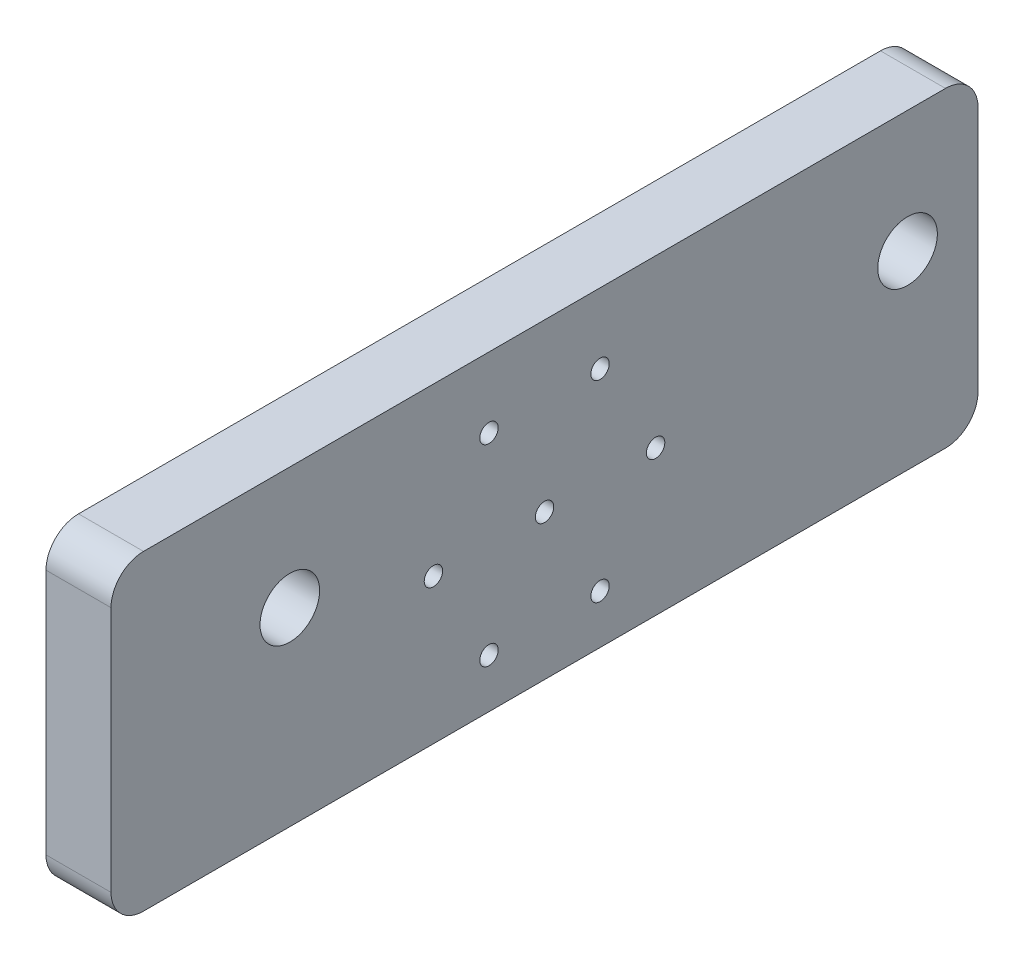
ISO-10303-21;
HEADER;
FILE_DESCRIPTION(('STEP AP214'),'2;1');
FILE_NAME('part.step','',(''),(''),'','','');
FILE_SCHEMA(('AUTOMOTIVE_DESIGN { 1 0 10303 214 1 1 1 1 }'));
ENDSEC;
DATA;
#1=APPLICATION_CONTEXT('core data for automotive mechanical design processes');
#2=APPLICATION_PROTOCOL_DEFINITION('international standard','automotive_design',2000,#1);
#3=PRODUCT_CONTEXT('',#1,'mechanical');
#4=PRODUCT('Part','Part','',(#3));
#5=PRODUCT_RELATED_PRODUCT_CATEGORY('part','',(#4));
#6=PRODUCT_DEFINITION_FORMATION('','',#4);
#7=PRODUCT_DEFINITION_CONTEXT('part definition',#1,'design');
#8=PRODUCT_DEFINITION('design','',#6,#7);
#9=PRODUCT_DEFINITION_SHAPE('','',#8);
#10=(LENGTH_UNIT() NAMED_UNIT(*) SI_UNIT(.MILLI.,.METRE.));
#11=(NAMED_UNIT(*) PLANE_ANGLE_UNIT() SI_UNIT($,.RADIAN.));
#12=(NAMED_UNIT(*) SI_UNIT($,.STERADIAN.) SOLID_ANGLE_UNIT());
#13=UNCERTAINTY_MEASURE_WITH_UNIT(LENGTH_MEASURE(1.E-05),#10,'distance_accuracy_value','');
#14=(GEOMETRIC_REPRESENTATION_CONTEXT(3) GLOBAL_UNCERTAINTY_ASSIGNED_CONTEXT((#13)) GLOBAL_UNIT_ASSIGNED_CONTEXT((#10,
#11,#12)) REPRESENTATION_CONTEXT('',''));
#15=CARTESIAN_POINT('',(0.,0.,0.));
#16=DIRECTION('',(0.,0.,1.));
#17=DIRECTION('',(1.,0.,0.));
#18=AXIS2_PLACEMENT_3D('',#15,#16,#17);
#19=CARTESIAN_POINT('',(0.,0.,0.));
#20=DIRECTION('',(1.,0.,0.));
#21=DIRECTION('',(0.,0.,-1.));
#22=AXIS2_PLACEMENT_3D('',#19,#20,#21);
#23=PLANE('',#22);
#24=DIRECTION('',(0.,1.,0.));
#25=VECTOR('',#24,1.);
#26=CARTESIAN_POINT('',(0.,14.375,-40.));
#27=LINE('',#26,#25);
#28=CARTESIAN_POINT('',(0.,-11.375,-40.));
#29=VERTEX_POINT('',#28);
#30=CARTESIAN_POINT('',(0.,11.375,-40.));
#31=VERTEX_POINT('',#30);
#32=EDGE_CURVE('E255',#29,#31,#27,.T.);
#33=ORIENTED_EDGE('',*,*,#32,.F.);
#34=CARTESIAN_POINT('',(0.,-11.375,-37.));
#35=DIRECTION('',(1.,0.,0.));
#36=DIRECTION('',(0.,0.,-1.));
#37=AXIS2_PLACEMENT_3D('',#34,#35,#36);
#38=CIRCLE('',#37,3.);
#39=CARTESIAN_POINT('',(0.,-14.375,-37.));
#40=VERTEX_POINT('',#39);
#41=EDGE_CURVE('E220',#29,#40,#38,.F.);
#42=ORIENTED_EDGE('',*,*,#41,.T.);
#43=DIRECTION('',(0.,0.,-1.));
#44=VECTOR('',#43,1.);
#45=CARTESIAN_POINT('',(0.,-14.375,40.));
#46=LINE('',#45,#44);
#47=CARTESIAN_POINT('',(0.,-14.375,37.));
#48=VERTEX_POINT('',#47);
#49=EDGE_CURVE('E257',#48,#40,#46,.T.);
#50=ORIENTED_EDGE('',*,*,#49,.F.);
#51=CARTESIAN_POINT('',(0.,-11.375,37.));
#52=DIRECTION('',(1.,0.,0.));
#53=DIRECTION('',(0.,0.,-1.));
#54=AXIS2_PLACEMENT_3D('',#51,#52,#53);
#55=CIRCLE('',#54,3.);
#56=CARTESIAN_POINT('',(0.,-11.375,40.));
#57=VERTEX_POINT('',#56);
#58=EDGE_CURVE('E214',#48,#57,#55,.F.);
#59=ORIENTED_EDGE('',*,*,#58,.T.);
#60=DIRECTION('',(0.,-1.,0.));
#61=VECTOR('',#60,1.);
#62=CARTESIAN_POINT('',(0.,14.375,40.));
#63=LINE('',#62,#61);
#64=CARTESIAN_POINT('',(0.,11.375,40.));
#65=VERTEX_POINT('',#64);
#66=EDGE_CURVE('E254',#65,#57,#63,.T.);
#67=ORIENTED_EDGE('',*,*,#66,.F.);
#68=CARTESIAN_POINT('',(0.,11.375,37.));
#69=DIRECTION('',(1.,0.,0.));
#70=DIRECTION('',(0.,0.,-1.));
#71=AXIS2_PLACEMENT_3D('',#68,#69,#70);
#72=CIRCLE('',#71,3.);
#73=CARTESIAN_POINT('',(0.,14.375,37.));
#74=VERTEX_POINT('',#73);
#75=EDGE_CURVE('E216',#65,#74,#72,.F.);
#76=ORIENTED_EDGE('',*,*,#75,.T.);
#77=DIRECTION('',(0.,0.,1.));
#78=VECTOR('',#77,1.);
#79=CARTESIAN_POINT('',(0.,14.375,40.));
#80=LINE('',#79,#78);
#81=CARTESIAN_POINT('',(0.,14.375,-37.));
#82=VERTEX_POINT('',#81);
#83=EDGE_CURVE('E244',#82,#74,#80,.T.);
#84=ORIENTED_EDGE('',*,*,#83,.F.);
#85=CARTESIAN_POINT('',(0.,11.375,-37.));
#86=DIRECTION('',(1.,0.,0.));
#87=DIRECTION('',(0.,0.,-1.));
#88=AXIS2_PLACEMENT_3D('',#85,#86,#87);
#89=CIRCLE('',#88,3.);
#90=EDGE_CURVE('E218',#82,#31,#89,.F.);
#91=ORIENTED_EDGE('',*,*,#90,.T.);
#92=EDGE_LOOP('',(#33,#42,#50,#59,#67,#76,#84,#91));
#93=FACE_BOUND('',#92,.T.);
#94=CARTESIAN_POINT('',(0.,3.125,23.5));
#95=DIRECTION('',(-1.,0.,0.));
#96=DIRECTION('',(0.,0.,1.));
#97=AXIS2_PLACEMENT_3D('',#94,#95,#96);
#98=CIRCLE('',#97,2.74999999999999);
#99=CARTESIAN_POINT('',(0.,3.125,26.25));
#100=VERTEX_POINT('',#99);
#101=EDGE_CURVE('E426',#100,#100,#98,.T.);
#102=ORIENTED_EDGE('',*,*,#101,.F.);
#103=EDGE_LOOP('',(#102));
#104=FACE_BOUND('',#103,.T.);
#105=CARTESIAN_POINT('',(0.,3.125,-33.5));
#106=DIRECTION('',(-1.,0.,0.));
#107=DIRECTION('',(0.,0.,1.));
#108=AXIS2_PLACEMENT_3D('',#105,#106,#107);
#109=CIRCLE('',#108,2.74999999999999);
#110=CARTESIAN_POINT('',(0.,3.125,-30.75));
#111=VERTEX_POINT('',#110);
#112=EDGE_CURVE('E421',#111,#111,#109,.T.);
#113=ORIENTED_EDGE('',*,*,#112,.F.);
#114=EDGE_LOOP('',(#113));
#115=FACE_BOUND('',#114,.T.);
#116=DIRECTION('',(0.,-1.,0.));
#117=VECTOR('',#116,1.);
#118=CARTESIAN_POINT('',(0.,0.,14.75));
#119=LINE('',#118,#117);
#120=CARTESIAN_POINT('',(0.,8.90176038879049,14.75));
#121=VERTEX_POINT('',#120);
#122=CARTESIAN_POINT('',(0.,-10.8517603887905,14.75));
#123=VERTEX_POINT('',#122);
#124=EDGE_CURVE('E460',#121,#123,#119,.T.);
#125=ORIENTED_EDGE('',*,*,#124,.T.);
#126=CARTESIAN_POINT('',(0.,-10.8517603887905,12.75));
#127=DIRECTION('',(1.,0.,0.));
#128=DIRECTION('',(0.,0.,-1.));
#129=AXIS2_PLACEMENT_3D('',#126,#127,#128);
#130=CIRCLE('',#129,2.);
#131=CARTESIAN_POINT('',(0.,-12.8517603887905,12.75));
#132=VERTEX_POINT('',#131);
#133=EDGE_CURVE('E158',#123,#132,#130,.T.);
#134=ORIENTED_EDGE('',*,*,#133,.T.);
#135=DIRECTION('',(0.,0.,-1.));
#136=VECTOR('',#135,1.);
#137=CARTESIAN_POINT('',(0.,-12.8517603887905,0.));
#138=LINE('',#137,#136);
#139=CARTESIAN_POINT('',(0.,-12.8517603887905,-12.75));
#140=VERTEX_POINT('',#139);
#141=EDGE_CURVE('E153',#132,#140,#138,.T.);
#142=ORIENTED_EDGE('',*,*,#141,.T.);
#143=CARTESIAN_POINT('',(0.,-10.8517603887905,-12.75));
#144=DIRECTION('',(1.,0.,0.));
#145=DIRECTION('',(0.,0.,-1.));
#146=AXIS2_PLACEMENT_3D('',#143,#144,#145);
#147=CIRCLE('',#146,2.);
#148=CARTESIAN_POINT('',(0.,-10.8517603887905,-14.75));
#149=VERTEX_POINT('',#148);
#150=EDGE_CURVE('E148',#140,#149,#147,.T.);
#151=ORIENTED_EDGE('',*,*,#150,.T.);
#152=DIRECTION('',(0.,1.,0.));
#153=VECTOR('',#152,1.);
#154=CARTESIAN_POINT('',(0.,0.,-14.75));
#155=LINE('',#154,#153);
#156=CARTESIAN_POINT('',(0.,8.90176038879049,-14.75));
#157=VERTEX_POINT('',#156);
#158=EDGE_CURVE('E151',#149,#157,#155,.T.);
#159=ORIENTED_EDGE('',*,*,#158,.T.);
#160=CARTESIAN_POINT('',(0.,8.90176038879049,-12.75));
#161=DIRECTION('',(1.,0.,0.));
#162=DIRECTION('',(0.,0.,-1.));
#163=AXIS2_PLACEMENT_3D('',#160,#161,#162);
#164=CIRCLE('',#163,2.);
#165=CARTESIAN_POINT('',(0.,10.9017603887905,-12.75));
#166=VERTEX_POINT('',#165);
#167=EDGE_CURVE('E159',#157,#166,#164,.T.);
#168=ORIENTED_EDGE('',*,*,#167,.T.);
#169=DIRECTION('',(0.,0.,1.));
#170=VECTOR('',#169,1.);
#171=CARTESIAN_POINT('',(0.,10.9017603887905,0.));
#172=LINE('',#171,#170);
#173=CARTESIAN_POINT('',(0.,10.9017603887905,12.75));
#174=VERTEX_POINT('',#173);
#175=EDGE_CURVE('E169',#166,#174,#172,.T.);
#176=ORIENTED_EDGE('',*,*,#175,.T.);
#177=CARTESIAN_POINT('',(0.,8.90176038879049,12.75));
#178=DIRECTION('',(1.,0.,0.));
#179=DIRECTION('',(0.,0.,-1.));
#180=AXIS2_PLACEMENT_3D('',#177,#178,#179);
#181=CIRCLE('',#180,2.);
#182=EDGE_CURVE('E207',#174,#121,#181,.T.);
#183=ORIENTED_EDGE('',*,*,#182,.T.);
#184=EDGE_LOOP('',(#125,#134,#142,#151,#159,#168,#176,#183));
#185=FACE_BOUND('',#184,.T.);
#186=ADVANCED_FACE('F34',(#93,#104,#115,#185),#23,.F.);
#187=CARTESIAN_POINT('',(6.,14.375,-40.));
#188=DIRECTION('',(0.,0.,1.));
#189=DIRECTION('',(0.,-1.,0.));
#190=AXIS2_PLACEMENT_3D('',#187,#188,#189);
#191=PLANE('',#190);
#192=DIRECTION('',(0.,1.,0.));
#193=VECTOR('',#192,1.);
#194=CARTESIAN_POINT('',(6.,14.375,-40.));
#195=LINE('',#194,#193);
#196=CARTESIAN_POINT('',(6.,-11.375,-40.));
#197=VERTEX_POINT('',#196);
#198=CARTESIAN_POINT('',(6.,11.375,-40.));
#199=VERTEX_POINT('',#198);
#200=EDGE_CURVE('E262',#197,#199,#195,.T.);
#201=ORIENTED_EDGE('',*,*,#200,.F.);
#202=DIRECTION('',(-1.,0.,0.));
#203=VECTOR('',#202,1.);
#204=CARTESIAN_POINT('',(6.,-11.375,-40.));
#205=LINE('',#204,#203);
#206=EDGE_CURVE('E211',#197,#29,#205,.T.);
#207=ORIENTED_EDGE('',*,*,#206,.T.);
#208=ORIENTED_EDGE('',*,*,#32,.T.);
#209=DIRECTION('',(-1.,0.,0.));
#210=VECTOR('',#209,1.);
#211=CARTESIAN_POINT('',(6.,11.375,-40.));
#212=LINE('',#211,#210);
#213=EDGE_CURVE('E209',#31,#199,#212,.F.);
#214=ORIENTED_EDGE('',*,*,#213,.T.);
#215=EDGE_LOOP('',(#201,#207,#208,#214));
#216=FACE_BOUND('',#215,.T.);
#217=ADVANCED_FACE('F285',(#216),#191,.F.);
#218=CARTESIAN_POINT('',(6.,14.375,40.));
#219=DIRECTION('',(0.,-1.,0.));
#220=DIRECTION('',(0.,0.,-1.));
#221=AXIS2_PLACEMENT_3D('',#218,#219,#220);
#222=PLANE('',#221);
#223=DIRECTION('',(0.,0.,1.));
#224=VECTOR('',#223,1.);
#225=CARTESIAN_POINT('',(6.,14.375,40.));
#226=LINE('',#225,#224);
#227=CARTESIAN_POINT('',(6.,14.375,-37.));
#228=VERTEX_POINT('',#227);
#229=CARTESIAN_POINT('',(6.,14.375,37.));
#230=VERTEX_POINT('',#229);
#231=EDGE_CURVE('E246',#228,#230,#226,.T.);
#232=ORIENTED_EDGE('',*,*,#231,.F.);
#233=DIRECTION('',(-1.,0.,0.));
#234=VECTOR('',#233,1.);
#235=CARTESIAN_POINT('',(6.,14.375,-37.));
#236=LINE('',#235,#234);
#237=EDGE_CURVE('E236',#228,#82,#236,.T.);
#238=ORIENTED_EDGE('',*,*,#237,.T.);
#239=ORIENTED_EDGE('',*,*,#83,.T.);
#240=DIRECTION('',(-1.,0.,0.));
#241=VECTOR('',#240,1.);
#242=CARTESIAN_POINT('',(6.,14.375,37.));
#243=LINE('',#242,#241);
#244=EDGE_CURVE('E234',#74,#230,#243,.F.);
#245=ORIENTED_EDGE('',*,*,#244,.T.);
#246=EDGE_LOOP('',(#232,#238,#239,#245));
#247=FACE_BOUND('',#246,.T.);
#248=ADVANCED_FACE('F243',(#247),#222,.F.);
#249=CARTESIAN_POINT('',(6.,14.375,40.));
#250=DIRECTION('',(0.,0.,-1.));
#251=DIRECTION('',(0.,1.,0.));
#252=AXIS2_PLACEMENT_3D('',#249,#250,#251);
#253=PLANE('',#252);
#254=DIRECTION('',(0.,-1.,0.));
#255=VECTOR('',#254,1.);
#256=CARTESIAN_POINT('',(6.,14.375,40.));
#257=LINE('',#256,#255);
#258=CARTESIAN_POINT('',(6.,11.375,40.));
#259=VERTEX_POINT('',#258);
#260=CARTESIAN_POINT('',(6.,-11.375,40.));
#261=VERTEX_POINT('',#260);
#262=EDGE_CURVE('E179',#259,#261,#257,.T.);
#263=ORIENTED_EDGE('',*,*,#262,.F.);
#264=DIRECTION('',(-1.,0.,0.));
#265=VECTOR('',#264,1.);
#266=CARTESIAN_POINT('',(6.,11.375,40.));
#267=LINE('',#266,#265);
#268=EDGE_CURVE('E11',#259,#65,#267,.T.);
#269=ORIENTED_EDGE('',*,*,#268,.T.);
#270=ORIENTED_EDGE('',*,*,#66,.T.);
#271=DIRECTION('',(-1.,0.,0.));
#272=VECTOR('',#271,1.);
#273=CARTESIAN_POINT('',(6.,-11.375,40.));
#274=LINE('',#273,#272);
#275=EDGE_CURVE('E42',#57,#261,#274,.F.);
#276=ORIENTED_EDGE('',*,*,#275,.T.);
#277=EDGE_LOOP('',(#263,#269,#270,#276));
#278=FACE_BOUND('',#277,.T.);
#279=ADVANCED_FACE('F290',(#278),#253,.F.);
#280=CARTESIAN_POINT('',(6.,-14.375,40.));
#281=DIRECTION('',(0.,1.,0.));
#282=DIRECTION('',(0.,0.,1.));
#283=AXIS2_PLACEMENT_3D('',#280,#281,#282);
#284=PLANE('',#283);
#285=ORIENTED_EDGE('',*,*,#49,.T.);
#286=DIRECTION('',(-1.,0.,0.));
#287=VECTOR('',#286,1.);
#288=CARTESIAN_POINT('',(6.,-14.375,-37.));
#289=LINE('',#288,#287);
#290=CARTESIAN_POINT('',(6.,-14.375,-37.));
#291=VERTEX_POINT('',#290);
#292=EDGE_CURVE('E225',#40,#291,#289,.F.);
#293=ORIENTED_EDGE('',*,*,#292,.T.);
#294=DIRECTION('',(0.,0.,-1.));
#295=VECTOR('',#294,1.);
#296=CARTESIAN_POINT('',(6.,-14.375,40.));
#297=LINE('',#296,#295);
#298=CARTESIAN_POINT('',(6.,-14.375,37.));
#299=VERTEX_POINT('',#298);
#300=EDGE_CURVE('E174',#299,#291,#297,.T.);
#301=ORIENTED_EDGE('',*,*,#300,.F.);
#302=DIRECTION('',(-1.,0.,0.));
#303=VECTOR('',#302,1.);
#304=CARTESIAN_POINT('',(6.,-14.375,37.));
#305=LINE('',#304,#303);
#306=EDGE_CURVE('E222',#299,#48,#305,.T.);
#307=ORIENTED_EDGE('',*,*,#306,.T.);
#308=EDGE_LOOP('',(#285,#293,#301,#307));
#309=FACE_BOUND('',#308,.T.);
#310=ADVANCED_FACE('F279',(#309),#284,.F.);
#311=CARTESIAN_POINT('',(6.,0.,0.));
#312=DIRECTION('',(1.,0.,0.));
#313=DIRECTION('',(0.,0.,-1.));
#314=AXIS2_PLACEMENT_3D('',#311,#312,#313);
#315=PLANE('',#314);
#316=CARTESIAN_POINT('',(6.,-0.974999999999991,-10.25));
#317=DIRECTION('',(-1.,0.,0.));
#318=DIRECTION('',(0.,0.,1.));
#319=AXIS2_PLACEMENT_3D('',#316,#317,#318);
#320=CIRCLE('',#319,0.849999999999998);
#321=CARTESIAN_POINT('',(6.,-0.974999999999991,-9.4));
#322=VERTEX_POINT('',#321);
#323=EDGE_CURVE('E396',#322,#322,#320,.T.);
#324=ORIENTED_EDGE('',*,*,#323,.T.);
#325=EDGE_LOOP('',(#324));
#326=FACE_BOUND('',#325,.T.);
#327=CARTESIAN_POINT('',(6.,-0.974999999999995,10.25));
#328=DIRECTION('',(-1.,0.,0.));
#329=DIRECTION('',(0.,0.,1.));
#330=AXIS2_PLACEMENT_3D('',#327,#328,#329);
#331=CIRCLE('',#330,0.849999999999998);
#332=CARTESIAN_POINT('',(6.,-0.974999999999995,11.1));
#333=VERTEX_POINT('',#332);
#334=EDGE_CURVE('E399',#333,#333,#331,.T.);
#335=ORIENTED_EDGE('',*,*,#334,.T.);
#336=EDGE_LOOP('',(#335));
#337=FACE_BOUND('',#336,.T.);
#338=CARTESIAN_POINT('',(6.,-0.974999999999997,0.));
#339=DIRECTION('',(-1.,0.,0.));
#340=DIRECTION('',(0.,0.,1.));
#341=AXIS2_PLACEMENT_3D('',#338,#339,#340);
#342=CIRCLE('',#341,0.849999999999998);
#343=CARTESIAN_POINT('',(6.,-0.974999999999997,0.849999999999998));
#344=VERTEX_POINT('',#343);
#345=EDGE_CURVE('E406',#344,#344,#342,.T.);
#346=ORIENTED_EDGE('',*,*,#345,.T.);
#347=EDGE_LOOP('',(#346));
#348=FACE_BOUND('',#347,.T.);
#349=CARTESIAN_POINT('',(6.,-9.85176038879047,-5.12500000000005));
#350=DIRECTION('',(-1.,0.,0.));
#351=DIRECTION('',(0.,0.,1.));
#352=AXIS2_PLACEMENT_3D('',#349,#350,#351);
#353=CIRCLE('',#352,0.849999999999998);
#354=CARTESIAN_POINT('',(6.,-9.85176038879047,-4.27500000000005));
#355=VERTEX_POINT('',#354);
#356=EDGE_CURVE('E409',#355,#355,#353,.T.);
#357=ORIENTED_EDGE('',*,*,#356,.T.);
#358=EDGE_LOOP('',(#357));
#359=FACE_BOUND('',#358,.T.);
#360=CARTESIAN_POINT('',(6.,-9.85176038879047,5.12500000000004));
#361=DIRECTION('',(-1.,0.,0.));
#362=DIRECTION('',(0.,0.,1.));
#363=AXIS2_PLACEMENT_3D('',#360,#361,#362);
#364=CIRCLE('',#363,0.849999999999998);
#365=CARTESIAN_POINT('',(6.,-9.85176038879047,5.97500000000004));
#366=VERTEX_POINT('',#365);
#367=EDGE_CURVE('E412',#366,#366,#364,.T.);
#368=ORIENTED_EDGE('',*,*,#367,.T.);
#369=EDGE_LOOP('',(#368));
#370=FACE_BOUND('',#369,.T.);
#371=CARTESIAN_POINT('',(6.,7.90176038879048,5.12500000000005));
#372=DIRECTION('',(-1.,0.,0.));
#373=DIRECTION('',(0.,0.,1.));
#374=AXIS2_PLACEMENT_3D('',#371,#372,#373);
#375=CIRCLE('',#374,0.849999999999998);
#376=CARTESIAN_POINT('',(6.,7.90176038879048,5.97500000000004));
#377=VERTEX_POINT('',#376);
#378=EDGE_CURVE('E415',#377,#377,#375,.T.);
#379=ORIENTED_EDGE('',*,*,#378,.T.);
#380=EDGE_LOOP('',(#379));
#381=FACE_BOUND('',#380,.T.);
#382=CARTESIAN_POINT('',(6.,7.90176038879047,-5.12500000000004));
#383=DIRECTION('',(-1.,0.,0.));
#384=DIRECTION('',(0.,0.,1.));
#385=AXIS2_PLACEMENT_3D('',#382,#383,#384);
#386=CIRCLE('',#385,0.849999999999998);
#387=CARTESIAN_POINT('',(6.,7.90176038879047,-4.27500000000004));
#388=VERTEX_POINT('',#387);
#389=EDGE_CURVE('E418',#388,#388,#386,.T.);
#390=ORIENTED_EDGE('',*,*,#389,.T.);
#391=EDGE_LOOP('',(#390));
#392=FACE_BOUND('',#391,.T.);
#393=CARTESIAN_POINT('',(6.,3.125,-33.5));
#394=DIRECTION('',(-1.,0.,0.));
#395=DIRECTION('',(0.,0.,1.));
#396=AXIS2_PLACEMENT_3D('',#393,#394,#395);
#397=CIRCLE('',#396,2.75);
#398=CARTESIAN_POINT('',(6.,3.125,-30.75));
#399=VERTEX_POINT('',#398);
#400=EDGE_CURVE('E424',#399,#399,#397,.T.);
#401=ORIENTED_EDGE('',*,*,#400,.T.);
#402=EDGE_LOOP('',(#401));
#403=FACE_BOUND('',#402,.T.);
#404=CARTESIAN_POINT('',(6.,3.125,23.5));
#405=DIRECTION('',(-1.,0.,0.));
#406=DIRECTION('',(0.,0.,1.));
#407=AXIS2_PLACEMENT_3D('',#404,#405,#406);
#408=CIRCLE('',#407,2.75);
#409=CARTESIAN_POINT('',(6.,3.125,26.25));
#410=VERTEX_POINT('',#409);
#411=EDGE_CURVE('E259',#410,#410,#408,.T.);
#412=ORIENTED_EDGE('',*,*,#411,.T.);
#413=EDGE_LOOP('',(#412));
#414=FACE_BOUND('',#413,.T.);
#415=ORIENTED_EDGE('',*,*,#300,.T.);
#416=CARTESIAN_POINT('',(6.,-11.375,-37.));
#417=DIRECTION('',(1.,0.,0.));
#418=DIRECTION('',(0.,0.,-1.));
#419=AXIS2_PLACEMENT_3D('',#416,#417,#418);
#420=CIRCLE('',#419,3.);
#421=EDGE_CURVE('E232',#291,#197,#420,.T.);
#422=ORIENTED_EDGE('',*,*,#421,.T.);
#423=ORIENTED_EDGE('',*,*,#200,.T.);
#424=CARTESIAN_POINT('',(6.,11.375,-37.));
#425=DIRECTION('',(1.,0.,0.));
#426=DIRECTION('',(0.,0.,-1.));
#427=AXIS2_PLACEMENT_3D('',#424,#425,#426);
#428=CIRCLE('',#427,3.);
#429=EDGE_CURVE('E230',#199,#228,#428,.T.);
#430=ORIENTED_EDGE('',*,*,#429,.T.);
#431=ORIENTED_EDGE('',*,*,#231,.T.);
#432=CARTESIAN_POINT('',(6.,11.375,37.));
#433=DIRECTION('',(1.,0.,0.));
#434=DIRECTION('',(0.,0.,-1.));
#435=AXIS2_PLACEMENT_3D('',#432,#433,#434);
#436=CIRCLE('',#435,3.);
#437=EDGE_CURVE('E55',#230,#259,#436,.T.);
#438=ORIENTED_EDGE('',*,*,#437,.T.);
#439=ORIENTED_EDGE('',*,*,#262,.T.);
#440=CARTESIAN_POINT('',(6.,-11.375,37.));
#441=DIRECTION('',(1.,0.,0.));
#442=DIRECTION('',(0.,0.,-1.));
#443=AXIS2_PLACEMENT_3D('',#440,#441,#442);
#444=CIRCLE('',#443,3.);
#445=EDGE_CURVE('E227',#261,#299,#444,.T.);
#446=ORIENTED_EDGE('',*,*,#445,.T.);
#447=EDGE_LOOP('',(#415,#422,#423,#430,#431,#438,#439,#446));
#448=FACE_BOUND('',#447,.T.);
#449=ADVANCED_FACE('F274',(#326,#337,#348,#359,#370,#381,#392,#403,#414,#448),#315,.T.);
#450=CARTESIAN_POINT('',(0.,3.125,23.5));
#451=DIRECTION('',(-1.,0.,0.));
#452=DIRECTION('',(0.,0.,1.));
#453=AXIS2_PLACEMENT_3D('',#450,#451,#452);
#454=CYLINDRICAL_SURFACE('',#453,2.74999999999999);
#455=ORIENTED_EDGE('',*,*,#411,.F.);
#456=EDGE_LOOP('',(#455));
#457=FACE_BOUND('',#456,.T.);
#458=ORIENTED_EDGE('',*,*,#101,.T.);
#459=EDGE_LOOP('',(#458));
#460=FACE_BOUND('',#459,.T.);
#461=ADVANCED_FACE('F308',(#457,#460),#454,.F.);
#462=CARTESIAN_POINT('',(0.,3.125,-33.5));
#463=DIRECTION('',(-1.,0.,0.));
#464=DIRECTION('',(0.,0.,1.));
#465=AXIS2_PLACEMENT_3D('',#462,#463,#464);
#466=CYLINDRICAL_SURFACE('',#465,2.74999999999999);
#467=ORIENTED_EDGE('',*,*,#400,.F.);
#468=EDGE_LOOP('',(#467));
#469=FACE_BOUND('',#468,.T.);
#470=ORIENTED_EDGE('',*,*,#112,.T.);
#471=EDGE_LOOP('',(#470));
#472=FACE_BOUND('',#471,.T.);
#473=ADVANCED_FACE('F312',(#469,#472),#466,.F.);
#474=CARTESIAN_POINT('',(0.,7.90176038879047,-5.12500000000004));
#475=DIRECTION('',(-1.,0.,0.));
#476=DIRECTION('',(0.,0.,1.));
#477=AXIS2_PLACEMENT_3D('',#474,#475,#476);
#478=CYLINDRICAL_SURFACE('',#477,0.849999999999993);
#479=CARTESIAN_POINT('',(2.,7.90176038879047,-5.12500000000004));
#480=DIRECTION('',(1.,0.,0.));
#481=DIRECTION('',(0.,0.,-1.));
#482=AXIS2_PLACEMENT_3D('',#479,#480,#481);
#483=CIRCLE('',#482,0.849999999999993);
#484=CARTESIAN_POINT('',(2.,7.90176038879047,-5.97500000000003));
#485=VERTEX_POINT('',#484);
#486=EDGE_CURVE('E395',#485,#485,#483,.F.);
#487=ORIENTED_EDGE('',*,*,#486,.T.);
#488=EDGE_LOOP('',(#487));
#489=FACE_BOUND('',#488,.T.);
#490=ORIENTED_EDGE('',*,*,#389,.F.);
#491=EDGE_LOOP('',(#490));
#492=FACE_BOUND('',#491,.T.);
#493=ADVANCED_FACE('F316',(#489,#492),#478,.F.);
#494=CARTESIAN_POINT('',(0.,7.90176038879048,5.12500000000005));
#495=DIRECTION('',(-1.,0.,0.));
#496=DIRECTION('',(0.,0.,1.));
#497=AXIS2_PLACEMENT_3D('',#494,#495,#496);
#498=CYLINDRICAL_SURFACE('',#497,0.849999999999993);
#499=CARTESIAN_POINT('',(2.,7.90176038879048,5.12500000000005));
#500=DIRECTION('',(1.,0.,0.));
#501=DIRECTION('',(0.,0.,-1.));
#502=AXIS2_PLACEMENT_3D('',#499,#500,#501);
#503=CIRCLE('',#502,0.849999999999993);
#504=CARTESIAN_POINT('',(2.,7.90176038879048,4.27500000000005));
#505=VERTEX_POINT('',#504);
#506=EDGE_CURVE('E368',#505,#505,#503,.F.);
#507=ORIENTED_EDGE('',*,*,#506,.T.);
#508=EDGE_LOOP('',(#507));
#509=FACE_BOUND('',#508,.T.);
#510=ORIENTED_EDGE('',*,*,#378,.F.);
#511=EDGE_LOOP('',(#510));
#512=FACE_BOUND('',#511,.T.);
#513=ADVANCED_FACE('F320',(#509,#512),#498,.F.);
#514=CARTESIAN_POINT('',(0.,-9.85176038879047,5.12500000000004));
#515=DIRECTION('',(-1.,0.,0.));
#516=DIRECTION('',(0.,0.,1.));
#517=AXIS2_PLACEMENT_3D('',#514,#515,#516);
#518=CYLINDRICAL_SURFACE('',#517,0.849999999999993);
#519=CARTESIAN_POINT('',(2.,-9.85176038879047,5.12500000000004));
#520=DIRECTION('',(1.,0.,0.));
#521=DIRECTION('',(0.,0.,-1.));
#522=AXIS2_PLACEMENT_3D('',#519,#520,#521);
#523=CIRCLE('',#522,0.849999999999993);
#524=CARTESIAN_POINT('',(2.,-9.85176038879047,4.27500000000004));
#525=VERTEX_POINT('',#524);
#526=EDGE_CURVE('E392',#525,#525,#523,.F.);
#527=ORIENTED_EDGE('',*,*,#526,.T.);
#528=EDGE_LOOP('',(#527));
#529=FACE_BOUND('',#528,.T.);
#530=ORIENTED_EDGE('',*,*,#367,.F.);
#531=EDGE_LOOP('',(#530));
#532=FACE_BOUND('',#531,.T.);
#533=ADVANCED_FACE('F324',(#529,#532),#518,.F.);
#534=CARTESIAN_POINT('',(0.,-9.85176038879047,-5.12500000000005));
#535=DIRECTION('',(-1.,0.,0.));
#536=DIRECTION('',(0.,0.,1.));
#537=AXIS2_PLACEMENT_3D('',#534,#535,#536);
#538=CYLINDRICAL_SURFACE('',#537,0.849999999999993);
#539=CARTESIAN_POINT('',(2.,-9.85176038879047,-5.12500000000005));
#540=DIRECTION('',(1.,0.,0.));
#541=DIRECTION('',(0.,0.,-1.));
#542=AXIS2_PLACEMENT_3D('',#539,#540,#541);
#543=CIRCLE('',#542,0.849999999999993);
#544=CARTESIAN_POINT('',(2.,-9.85176038879047,-5.97500000000004));
#545=VERTEX_POINT('',#544);
#546=EDGE_CURVE('E372',#545,#545,#543,.F.);
#547=ORIENTED_EDGE('',*,*,#546,.T.);
#548=EDGE_LOOP('',(#547));
#549=FACE_BOUND('',#548,.T.);
#550=ORIENTED_EDGE('',*,*,#356,.F.);
#551=EDGE_LOOP('',(#550));
#552=FACE_BOUND('',#551,.T.);
#553=ADVANCED_FACE('F328',(#549,#552),#538,.F.);
#554=CARTESIAN_POINT('',(0.,-0.974999999999997,0.));
#555=DIRECTION('',(-1.,0.,0.));
#556=DIRECTION('',(0.,0.,1.));
#557=AXIS2_PLACEMENT_3D('',#554,#555,#556);
#558=CYLINDRICAL_SURFACE('',#557,0.849999999999993);
#559=CARTESIAN_POINT('',(2.,-0.974999999999997,0.));
#560=DIRECTION('',(1.,0.,0.));
#561=DIRECTION('',(0.,0.,-1.));
#562=AXIS2_PLACEMENT_3D('',#559,#560,#561);
#563=CIRCLE('',#562,0.849999999999993);
#564=CARTESIAN_POINT('',(2.,-0.974999999999997,-0.849999999999993));
#565=VERTEX_POINT('',#564);
#566=EDGE_CURVE('E388',#565,#565,#563,.F.);
#567=ORIENTED_EDGE('',*,*,#566,.T.);
#568=EDGE_LOOP('',(#567));
#569=FACE_BOUND('',#568,.T.);
#570=ORIENTED_EDGE('',*,*,#345,.F.);
#571=EDGE_LOOP('',(#570));
#572=FACE_BOUND('',#571,.T.);
#573=ADVANCED_FACE('F332',(#569,#572),#558,.F.);
#574=CARTESIAN_POINT('',(0.,-0.974999999999995,10.25));
#575=DIRECTION('',(-1.,0.,0.));
#576=DIRECTION('',(0.,0.,1.));
#577=AXIS2_PLACEMENT_3D('',#574,#575,#576);
#578=CYLINDRICAL_SURFACE('',#577,0.849999999999993);
#579=CARTESIAN_POINT('',(2.,-0.974999999999995,10.25));
#580=DIRECTION('',(1.,0.,0.));
#581=DIRECTION('',(0.,0.,-1.));
#582=AXIS2_PLACEMENT_3D('',#579,#580,#581);
#583=CIRCLE('',#582,0.849999999999993);
#584=CARTESIAN_POINT('',(2.,-0.974999999999995,9.40000000000001));
#585=VERTEX_POINT('',#584);
#586=EDGE_CURVE('E376',#585,#585,#583,.F.);
#587=ORIENTED_EDGE('',*,*,#586,.T.);
#588=EDGE_LOOP('',(#587));
#589=FACE_BOUND('',#588,.T.);
#590=ORIENTED_EDGE('',*,*,#334,.F.);
#591=EDGE_LOOP('',(#590));
#592=FACE_BOUND('',#591,.T.);
#593=ADVANCED_FACE('F336',(#589,#592),#578,.F.);
#594=CARTESIAN_POINT('',(0.,-0.974999999999991,-10.25));
#595=DIRECTION('',(-1.,0.,0.));
#596=DIRECTION('',(0.,0.,1.));
#597=AXIS2_PLACEMENT_3D('',#594,#595,#596);
#598=CYLINDRICAL_SURFACE('',#597,0.849999999999993);
#599=CARTESIAN_POINT('',(2.,-0.974999999999991,-10.25));
#600=DIRECTION('',(1.,0.,0.));
#601=DIRECTION('',(0.,0.,-1.));
#602=AXIS2_PLACEMENT_3D('',#599,#600,#601);
#603=CIRCLE('',#602,0.849999999999993);
#604=CARTESIAN_POINT('',(2.,-0.974999999999991,-11.1));
#605=VERTEX_POINT('',#604);
#606=EDGE_CURVE('E182',#605,#605,#603,.F.);
#607=ORIENTED_EDGE('',*,*,#606,.T.);
#608=EDGE_LOOP('',(#607));
#609=FACE_BOUND('',#608,.T.);
#610=ORIENTED_EDGE('',*,*,#323,.F.);
#611=EDGE_LOOP('',(#610));
#612=FACE_BOUND('',#611,.T.);
#613=ADVANCED_FACE('F340',(#609,#612),#598,.F.);
#614=CARTESIAN_POINT('',(2.,0.,0.));
#615=DIRECTION('',(1.,0.,0.));
#616=DIRECTION('',(0.,0.,-1.));
#617=AXIS2_PLACEMENT_3D('',#614,#615,#616);
#618=PLANE('',#617);
#619=ORIENTED_EDGE('',*,*,#506,.F.);
#620=EDGE_LOOP('',(#619));
#621=FACE_BOUND('',#620,.T.);
#622=ORIENTED_EDGE('',*,*,#546,.F.);
#623=EDGE_LOOP('',(#622));
#624=FACE_BOUND('',#623,.T.);
#625=ORIENTED_EDGE('',*,*,#586,.F.);
#626=EDGE_LOOP('',(#625));
#627=FACE_BOUND('',#626,.T.);
#628=DIRECTION('',(0.,0.,1.));
#629=VECTOR('',#628,1.);
#630=CARTESIAN_POINT('',(2.,10.9017603887905,0.));
#631=LINE('',#630,#629);
#632=CARTESIAN_POINT('',(2.,10.9017603887905,-12.75));
#633=VERTEX_POINT('',#632);
#634=CARTESIAN_POINT('',(2.,10.9017603887905,12.75));
#635=VERTEX_POINT('',#634);
#636=EDGE_CURVE('E380',#633,#635,#631,.T.);
#637=ORIENTED_EDGE('',*,*,#636,.F.);
#638=CARTESIAN_POINT('',(2.,8.90176038879049,-12.75));
#639=DIRECTION('',(1.,0.,0.));
#640=DIRECTION('',(0.,0.,-1.));
#641=AXIS2_PLACEMENT_3D('',#638,#639,#640);
#642=CIRCLE('',#641,2.);
#643=CARTESIAN_POINT('',(2.,8.90176038879049,-14.75));
#644=VERTEX_POINT('',#643);
#645=EDGE_CURVE('E194',#633,#644,#642,.F.);
#646=ORIENTED_EDGE('',*,*,#645,.T.);
#647=DIRECTION('',(0.,1.,0.));
#648=VECTOR('',#647,1.);
#649=CARTESIAN_POINT('',(2.,0.,-14.75));
#650=LINE('',#649,#648);
#651=CARTESIAN_POINT('',(2.,-10.8517603887905,-14.75));
#652=VERTEX_POINT('',#651);
#653=EDGE_CURVE('E470',#652,#644,#650,.T.);
#654=ORIENTED_EDGE('',*,*,#653,.F.);
#655=CARTESIAN_POINT('',(2.,-10.8517603887905,-12.75));
#656=DIRECTION('',(1.,0.,0.));
#657=DIRECTION('',(0.,0.,-1.));
#658=AXIS2_PLACEMENT_3D('',#655,#656,#657);
#659=CIRCLE('',#658,2.);
#660=CARTESIAN_POINT('',(2.,-12.8517603887905,-12.75));
#661=VERTEX_POINT('',#660);
#662=EDGE_CURVE('E173',#652,#661,#659,.F.);
#663=ORIENTED_EDGE('',*,*,#662,.T.);
#664=DIRECTION('',(0.,0.,-1.));
#665=VECTOR('',#664,1.);
#666=CARTESIAN_POINT('',(2.,-12.8517603887905,0.));
#667=LINE('',#666,#665);
#668=CARTESIAN_POINT('',(2.,-12.8517603887905,12.75));
#669=VERTEX_POINT('',#668);
#670=EDGE_CURVE('E462',#669,#661,#667,.T.);
#671=ORIENTED_EDGE('',*,*,#670,.F.);
#672=CARTESIAN_POINT('',(2.,-10.8517603887905,12.75));
#673=DIRECTION('',(1.,0.,0.));
#674=DIRECTION('',(0.,0.,-1.));
#675=AXIS2_PLACEMENT_3D('',#672,#673,#674);
#676=CIRCLE('',#675,2.);
#677=CARTESIAN_POINT('',(2.,-10.8517603887905,14.75));
#678=VERTEX_POINT('',#677);
#679=EDGE_CURVE('E191',#669,#678,#676,.F.);
#680=ORIENTED_EDGE('',*,*,#679,.T.);
#681=DIRECTION('',(0.,-1.,0.));
#682=VECTOR('',#681,1.);
#683=CARTESIAN_POINT('',(2.,0.,14.75));
#684=LINE('',#683,#682);
#685=CARTESIAN_POINT('',(2.,8.90176038879049,14.75));
#686=VERTEX_POINT('',#685);
#687=EDGE_CURVE('E466',#686,#678,#684,.T.);
#688=ORIENTED_EDGE('',*,*,#687,.F.);
#689=CARTESIAN_POINT('',(2.,8.90176038879049,12.75));
#690=DIRECTION('',(1.,0.,0.));
#691=DIRECTION('',(0.,0.,-1.));
#692=AXIS2_PLACEMENT_3D('',#689,#690,#691);
#693=CIRCLE('',#692,2.);
#694=EDGE_CURVE('E189',#686,#635,#693,.F.);
#695=ORIENTED_EDGE('',*,*,#694,.T.);
#696=EDGE_LOOP('',(#637,#646,#654,#663,#671,#680,#688,#695));
#697=FACE_BOUND('',#696,.T.);
#698=ORIENTED_EDGE('',*,*,#606,.F.);
#699=EDGE_LOOP('',(#698));
#700=FACE_BOUND('',#699,.T.);
#701=ORIENTED_EDGE('',*,*,#566,.F.);
#702=EDGE_LOOP('',(#701));
#703=FACE_BOUND('',#702,.T.);
#704=ORIENTED_EDGE('',*,*,#526,.F.);
#705=EDGE_LOOP('',(#704));
#706=FACE_BOUND('',#705,.T.);
#707=ORIENTED_EDGE('',*,*,#486,.F.);
#708=EDGE_LOOP('',(#707));
#709=FACE_BOUND('',#708,.T.);
#710=ADVANCED_FACE('F344',(#621,#624,#627,#697,#700,#703,#706,#709),#618,.F.);
#711=CARTESIAN_POINT('',(2.,-12.8517603887905,0.));
#712=DIRECTION('',(0.,1.,0.));
#713=DIRECTION('',(0.,0.,1.));
#714=AXIS2_PLACEMENT_3D('',#711,#712,#713);
#715=PLANE('',#714);
#716=ORIENTED_EDGE('',*,*,#670,.T.);
#717=DIRECTION('',(-1.,0.,0.));
#718=VECTOR('',#717,1.);
#719=CARTESIAN_POINT('',(0.,-12.8517603887905,-12.75));
#720=LINE('',#719,#718);
#721=EDGE_CURVE('E198',#661,#140,#720,.T.);
#722=ORIENTED_EDGE('',*,*,#721,.T.);
#723=ORIENTED_EDGE('',*,*,#141,.F.);
#724=DIRECTION('',(-1.,0.,0.));
#725=VECTOR('',#724,1.);
#726=CARTESIAN_POINT('',(2.,-12.8517603887905,12.75));
#727=LINE('',#726,#725);
#728=EDGE_CURVE('E196',#132,#669,#727,.F.);
#729=ORIENTED_EDGE('',*,*,#728,.T.);
#730=EDGE_LOOP('',(#716,#722,#723,#729));
#731=FACE_BOUND('',#730,.T.);
#732=ADVANCED_FACE('F346',(#731),#715,.T.);
#733=CARTESIAN_POINT('',(2.,0.,-14.75));
#734=DIRECTION('',(0.,0.,1.));
#735=DIRECTION('',(1.,0.,0.));
#736=AXIS2_PLACEMENT_3D('',#733,#734,#735);
#737=PLANE('',#736);
#738=ORIENTED_EDGE('',*,*,#653,.T.);
#739=DIRECTION('',(-1.,0.,0.));
#740=VECTOR('',#739,1.);
#741=CARTESIAN_POINT('',(0.,8.90176038879049,-14.75));
#742=LINE('',#741,#740);
#743=EDGE_CURVE('E168',#644,#157,#742,.T.);
#744=ORIENTED_EDGE('',*,*,#743,.T.);
#745=ORIENTED_EDGE('',*,*,#158,.F.);
#746=DIRECTION('',(-1.,0.,0.));
#747=VECTOR('',#746,1.);
#748=CARTESIAN_POINT('',(2.,-10.8517603887905,-14.75));
#749=LINE('',#748,#747);
#750=EDGE_CURVE('E165',#149,#652,#749,.F.);
#751=ORIENTED_EDGE('',*,*,#750,.T.);
#752=EDGE_LOOP('',(#738,#744,#745,#751));
#753=FACE_BOUND('',#752,.T.);
#754=ADVANCED_FACE('F164',(#753),#737,.T.);
#755=CARTESIAN_POINT('',(2.,10.9017603887905,0.));
#756=DIRECTION('',(0.,-1.,0.));
#757=DIRECTION('',(0.,0.,-1.));
#758=AXIS2_PLACEMENT_3D('',#755,#756,#757);
#759=PLANE('',#758);
#760=ORIENTED_EDGE('',*,*,#175,.F.);
#761=DIRECTION('',(-1.,0.,0.));
#762=VECTOR('',#761,1.);
#763=CARTESIAN_POINT('',(2.,10.9017603887905,-12.75));
#764=LINE('',#763,#762);
#765=EDGE_CURVE('E187',#166,#633,#764,.F.);
#766=ORIENTED_EDGE('',*,*,#765,.T.);
#767=ORIENTED_EDGE('',*,*,#636,.T.);
#768=DIRECTION('',(-1.,0.,0.));
#769=VECTOR('',#768,1.);
#770=CARTESIAN_POINT('',(0.,10.9017603887905,12.75));
#771=LINE('',#770,#769);
#772=EDGE_CURVE('E176',#635,#174,#771,.T.);
#773=ORIENTED_EDGE('',*,*,#772,.T.);
#774=EDGE_LOOP('',(#760,#766,#767,#773));
#775=FACE_BOUND('',#774,.T.);
#776=ADVANCED_FACE('F352',(#775),#759,.T.);
#777=CARTESIAN_POINT('',(2.,0.,14.75));
#778=DIRECTION('',(0.,0.,-1.));
#779=DIRECTION('',(-1.,0.,0.));
#780=AXIS2_PLACEMENT_3D('',#777,#778,#779);
#781=PLANE('',#780);
#782=ORIENTED_EDGE('',*,*,#687,.T.);
#783=DIRECTION('',(-1.,0.,0.));
#784=VECTOR('',#783,1.);
#785=CARTESIAN_POINT('',(0.,-10.8517603887905,14.75));
#786=LINE('',#785,#784);
#787=EDGE_CURVE('E202',#678,#123,#786,.T.);
#788=ORIENTED_EDGE('',*,*,#787,.T.);
#789=ORIENTED_EDGE('',*,*,#124,.F.);
#790=DIRECTION('',(-1.,0.,0.));
#791=VECTOR('',#790,1.);
#792=CARTESIAN_POINT('',(2.,8.90176038879049,14.75));
#793=LINE('',#792,#791);
#794=EDGE_CURVE('E200',#121,#686,#793,.F.);
#795=ORIENTED_EDGE('',*,*,#794,.T.);
#796=EDGE_LOOP('',(#782,#788,#789,#795));
#797=FACE_BOUND('',#796,.T.);
#798=ADVANCED_FACE('F355',(#797),#781,.T.);
#799=CARTESIAN_POINT('',(2.,8.90176038879049,-12.75));
#800=DIRECTION('',(1.,0.,0.));
#801=DIRECTION('',(0.,0.,-1.));
#802=AXIS2_PLACEMENT_3D('',#799,#800,#801);
#803=CYLINDRICAL_SURFACE('',#802,2.);
#804=ORIENTED_EDGE('',*,*,#645,.F.);
#805=ORIENTED_EDGE('',*,*,#765,.F.);
#806=ORIENTED_EDGE('',*,*,#167,.F.);
#807=ORIENTED_EDGE('',*,*,#743,.F.);
#808=EDGE_LOOP('',(#804,#805,#806,#807));
#809=FACE_BOUND('',#808,.T.);
#810=ADVANCED_FACE('F359',(#809),#803,.F.);
#811=CARTESIAN_POINT('',(2.,-10.8517603887905,-12.75));
#812=DIRECTION('',(1.,0.,0.));
#813=DIRECTION('',(0.,0.,-1.));
#814=AXIS2_PLACEMENT_3D('',#811,#812,#813);
#815=CYLINDRICAL_SURFACE('',#814,2.);
#816=ORIENTED_EDGE('',*,*,#662,.F.);
#817=ORIENTED_EDGE('',*,*,#750,.F.);
#818=ORIENTED_EDGE('',*,*,#150,.F.);
#819=ORIENTED_EDGE('',*,*,#721,.F.);
#820=EDGE_LOOP('',(#816,#817,#818,#819));
#821=FACE_BOUND('',#820,.T.);
#822=ADVANCED_FACE('F172',(#821),#815,.F.);
#823=CARTESIAN_POINT('',(2.,-10.8517603887905,12.75));
#824=DIRECTION('',(1.,0.,0.));
#825=DIRECTION('',(0.,0.,-1.));
#826=AXIS2_PLACEMENT_3D('',#823,#824,#825);
#827=CYLINDRICAL_SURFACE('',#826,2.);
#828=ORIENTED_EDGE('',*,*,#679,.F.);
#829=ORIENTED_EDGE('',*,*,#728,.F.);
#830=ORIENTED_EDGE('',*,*,#133,.F.);
#831=ORIENTED_EDGE('',*,*,#787,.F.);
#832=EDGE_LOOP('',(#828,#829,#830,#831));
#833=FACE_BOUND('',#832,.T.);
#834=ADVANCED_FACE('F479',(#833),#827,.F.);
#835=CARTESIAN_POINT('',(2.,8.90176038879049,12.75));
#836=DIRECTION('',(1.,0.,0.));
#837=DIRECTION('',(0.,0.,-1.));
#838=AXIS2_PLACEMENT_3D('',#835,#836,#837);
#839=CYLINDRICAL_SURFACE('',#838,2.);
#840=ORIENTED_EDGE('',*,*,#694,.F.);
#841=ORIENTED_EDGE('',*,*,#794,.F.);
#842=ORIENTED_EDGE('',*,*,#182,.F.);
#843=ORIENTED_EDGE('',*,*,#772,.F.);
#844=EDGE_LOOP('',(#840,#841,#842,#843));
#845=FACE_BOUND('',#844,.T.);
#846=ADVANCED_FACE('F486',(#845),#839,.F.);
#847=CARTESIAN_POINT('',(6.,-11.375,-37.));
#848=DIRECTION('',(-1.,0.,0.));
#849=DIRECTION('',(0.,0.,1.));
#850=AXIS2_PLACEMENT_3D('',#847,#848,#849);
#851=CYLINDRICAL_SURFACE('',#850,3.);
#852=ORIENTED_EDGE('',*,*,#421,.F.);
#853=ORIENTED_EDGE('',*,*,#292,.F.);
#854=ORIENTED_EDGE('',*,*,#41,.F.);
#855=ORIENTED_EDGE('',*,*,#206,.F.);
#856=EDGE_LOOP('',(#852,#853,#854,#855));
#857=FACE_BOUND('',#856,.T.);
#858=ADVANCED_FACE('F283',(#857),#851,.T.);
#859=CARTESIAN_POINT('',(6.,11.375,-37.));
#860=DIRECTION('',(-1.,0.,0.));
#861=DIRECTION('',(0.,0.,1.));
#862=AXIS2_PLACEMENT_3D('',#859,#860,#861);
#863=CYLINDRICAL_SURFACE('',#862,3.);
#864=ORIENTED_EDGE('',*,*,#429,.F.);
#865=ORIENTED_EDGE('',*,*,#213,.F.);
#866=ORIENTED_EDGE('',*,*,#90,.F.);
#867=ORIENTED_EDGE('',*,*,#237,.F.);
#868=EDGE_LOOP('',(#864,#865,#866,#867));
#869=FACE_BOUND('',#868,.T.);
#870=ADVANCED_FACE('F287',(#869),#863,.T.);
#871=CARTESIAN_POINT('',(6.,11.375,37.));
#872=DIRECTION('',(-1.,0.,0.));
#873=DIRECTION('',(0.,0.,1.));
#874=AXIS2_PLACEMENT_3D('',#871,#872,#873);
#875=CYLINDRICAL_SURFACE('',#874,3.);
#876=ORIENTED_EDGE('',*,*,#437,.F.);
#877=ORIENTED_EDGE('',*,*,#244,.F.);
#878=ORIENTED_EDGE('',*,*,#75,.F.);
#879=ORIENTED_EDGE('',*,*,#268,.F.);
#880=EDGE_LOOP('',(#876,#877,#878,#879));
#881=FACE_BOUND('',#880,.T.);
#882=ADVANCED_FACE('F289',(#881),#875,.T.);
#883=CARTESIAN_POINT('',(6.,-11.375,37.));
#884=DIRECTION('',(-1.,0.,0.));
#885=DIRECTION('',(0.,0.,1.));
#886=AXIS2_PLACEMENT_3D('',#883,#884,#885);
#887=CYLINDRICAL_SURFACE('',#886,3.);
#888=ORIENTED_EDGE('',*,*,#445,.F.);
#889=ORIENTED_EDGE('',*,*,#275,.F.);
#890=ORIENTED_EDGE('',*,*,#58,.F.);
#891=ORIENTED_EDGE('',*,*,#306,.F.);
#892=EDGE_LOOP('',(#888,#889,#890,#891));
#893=FACE_BOUND('',#892,.T.);
#894=ADVANCED_FACE('F36',(#893),#887,.T.);
#895=CLOSED_SHELL('',(#186,#217,#248,#279,#310,#449,#461,#473,#493,#513,#533,#553,#573,#593,
#613,#710,#732,#754,#776,#798,#810,#822,#834,#846,#858,#870,#882,#894));
#896=MANIFOLD_SOLID_BREP('B2',#895);
#897=ADVANCED_BREP_SHAPE_REPRESENTATION('',(#18,#896),#14);
#898=SHAPE_DEFINITION_REPRESENTATION(#9,#897);
ENDSEC;
END-ISO-10303-21;
